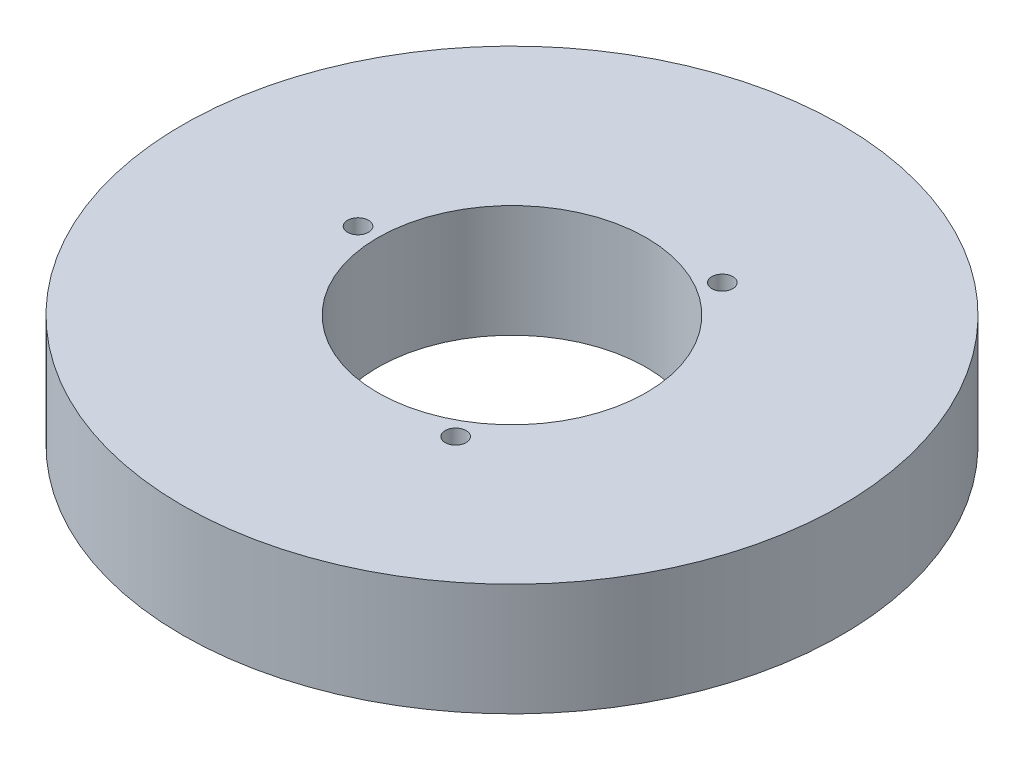
ISO-10303-21;
HEADER;
FILE_DESCRIPTION(('STEP AP214'),'2;1');
FILE_NAME('part.step','',(''),(''),'','','');
FILE_SCHEMA(('AUTOMOTIVE_DESIGN { 1 0 10303 214 1 1 1 1 }'));
ENDSEC;
DATA;
#1=APPLICATION_CONTEXT('core data for automotive mechanical design processes');
#2=APPLICATION_PROTOCOL_DEFINITION('international standard','automotive_design',2000,#1);
#3=PRODUCT_CONTEXT('',#1,'mechanical');
#4=PRODUCT('Part','Part','',(#3));
#5=PRODUCT_RELATED_PRODUCT_CATEGORY('part','',(#4));
#6=PRODUCT_DEFINITION_FORMATION('','',#4);
#7=PRODUCT_DEFINITION_CONTEXT('part definition',#1,'design');
#8=PRODUCT_DEFINITION('design','',#6,#7);
#9=PRODUCT_DEFINITION_SHAPE('','',#8);
#10=(LENGTH_UNIT() NAMED_UNIT(*) SI_UNIT(.MILLI.,.METRE.));
#11=(NAMED_UNIT(*) PLANE_ANGLE_UNIT() SI_UNIT($,.RADIAN.));
#12=(NAMED_UNIT(*) SI_UNIT($,.STERADIAN.) SOLID_ANGLE_UNIT());
#13=UNCERTAINTY_MEASURE_WITH_UNIT(LENGTH_MEASURE(1.E-05),#10,'distance_accuracy_value','');
#14=(GEOMETRIC_REPRESENTATION_CONTEXT(3) GLOBAL_UNCERTAINTY_ASSIGNED_CONTEXT((#13)) GLOBAL_UNIT_ASSIGNED_CONTEXT((#10,
#11,#12)) REPRESENTATION_CONTEXT('',''));
#15=CARTESIAN_POINT('',(0.,0.,0.));
#16=DIRECTION('',(0.,0.,1.));
#17=DIRECTION('',(1.,0.,0.));
#18=AXIS2_PLACEMENT_3D('',#15,#16,#17);
#19=CARTESIAN_POINT('',(0.,23.,0.));
#20=DIRECTION('',(0.,-1.,0.));
#21=DIRECTION('',(0.,0.,-1.));
#22=AXIS2_PLACEMENT_3D('',#19,#20,#21);
#23=CYLINDRICAL_SURFACE('',#22,67.5);
#24=CARTESIAN_POINT('',(0.,23.,0.));
#25=DIRECTION('',(0.,1.,0.));
#26=DIRECTION('',(0.,0.,1.));
#27=AXIS2_PLACEMENT_3D('',#24,#25,#26);
#28=CIRCLE('',#27,67.5);
#29=CARTESIAN_POINT('',(0.,23.,67.5));
#30=VERTEX_POINT('',#29);
#31=EDGE_CURVE('E10',#30,#30,#28,.T.);
#32=ORIENTED_EDGE('',*,*,#31,.F.);
#33=EDGE_LOOP('',(#32));
#34=FACE_BOUND('',#33,.T.);
#35=CARTESIAN_POINT('',(0.,0.,0.));
#36=DIRECTION('',(0.,1.,0.));
#37=DIRECTION('',(0.,0.,1.));
#38=AXIS2_PLACEMENT_3D('',#35,#36,#37);
#39=CIRCLE('',#38,67.5);
#40=CARTESIAN_POINT('',(0.,0.,67.5));
#41=VERTEX_POINT('',#40);
#42=EDGE_CURVE('E37',#41,#41,#39,.T.);
#43=ORIENTED_EDGE('',*,*,#42,.T.);
#44=EDGE_LOOP('',(#43));
#45=FACE_BOUND('',#44,.T.);
#46=ADVANCED_FACE('F40',(#34,#45),#23,.T.);
#47=CARTESIAN_POINT('',(0.,23.,0.));
#48=DIRECTION('',(0.,1.,0.));
#49=DIRECTION('',(0.,0.,1.));
#50=AXIS2_PLACEMENT_3D('',#47,#48,#49);
#51=PLANE('',#50);
#52=CARTESIAN_POINT('',(15.7669962282839,23.,27.3092385501344));
#53=DIRECTION('',(0.,1.,0.));
#54=DIRECTION('',(0.866025403784436,0.,-0.500000000000004));
#55=AXIS2_PLACEMENT_3D('',#52,#53,#54);
#56=CIRCLE('',#55,2.14732946866466);
#57=CARTESIAN_POINT('',(17.6266380984425,23.,26.235573815802));
#58=VERTEX_POINT('',#57);
#59=EDGE_CURVE('E70',#58,#58,#56,.T.);
#60=ORIENTED_EDGE('',*,*,#59,.F.);
#61=EDGE_LOOP('',(#60));
#62=FACE_BOUND('',#61,.T.);
#63=CARTESIAN_POINT('',(15.7669962282836,23.,-27.3092385501346));
#64=DIRECTION('',(0.,1.,0.));
#65=DIRECTION('',(-0.866025403784443,0.,-0.499999999999992));
#66=AXIS2_PLACEMENT_3D('',#63,#64,#65);
#67=CIRCLE('',#66,2.14732946866466);
#68=CARTESIAN_POINT('',(13.907354358125,23.,-28.3829032844669));
#69=VERTEX_POINT('',#68);
#70=EDGE_CURVE('E61',#69,#69,#67,.T.);
#71=ORIENTED_EDGE('',*,*,#70,.F.);
#72=EDGE_LOOP('',(#71));
#73=FACE_BOUND('',#72,.T.);
#74=CARTESIAN_POINT('',(-31.5339924565676,23.,0.));
#75=DIRECTION('',(0.,1.,0.));
#76=DIRECTION('',(0.,0.,1.));
#77=AXIS2_PLACEMENT_3D('',#74,#75,#76);
#78=CIRCLE('',#77,2.14732946866466);
#79=CARTESIAN_POINT('',(-31.5339924565676,23.,2.14732946866466));
#80=VERTEX_POINT('',#79);
#81=EDGE_CURVE('E54',#80,#80,#78,.T.);
#82=ORIENTED_EDGE('',*,*,#81,.F.);
#83=EDGE_LOOP('',(#82));
#84=FACE_BOUND('',#83,.T.);
#85=CARTESIAN_POINT('',(0.,23.,0.));
#86=DIRECTION('',(0.,1.,0.));
#87=DIRECTION('',(0.,0.,1.));
#88=AXIS2_PLACEMENT_3D('',#85,#86,#87);
#89=CIRCLE('',#88,27.5);
#90=CARTESIAN_POINT('',(0.,23.,27.5));
#91=VERTEX_POINT('',#90);
#92=EDGE_CURVE('E50',#91,#91,#89,.T.);
#93=ORIENTED_EDGE('',*,*,#92,.F.);
#94=EDGE_LOOP('',(#93));
#95=FACE_BOUND('',#94,.T.);
#96=ORIENTED_EDGE('',*,*,#31,.T.);
#97=EDGE_LOOP('',(#96));
#98=FACE_BOUND('',#97,.T.);
#99=ADVANCED_FACE('F85',(#62,#73,#84,#95,#98),#51,.T.);
#100=CARTESIAN_POINT('',(0.,0.,0.));
#101=DIRECTION('',(0.,1.,0.));
#102=DIRECTION('',(0.,0.,1.));
#103=AXIS2_PLACEMENT_3D('',#100,#101,#102);
#104=PLANE('',#103);
#105=CARTESIAN_POINT('',(0.,0.,0.));
#106=DIRECTION('',(0.,1.,0.));
#107=DIRECTION('',(0.,0.,1.));
#108=AXIS2_PLACEMENT_3D('',#105,#106,#107);
#109=CIRCLE('',#108,27.5);
#110=CARTESIAN_POINT('',(0.,0.,27.5));
#111=VERTEX_POINT('',#110);
#112=EDGE_CURVE('E47',#111,#111,#109,.T.);
#113=ORIENTED_EDGE('',*,*,#112,.T.);
#114=EDGE_LOOP('',(#113));
#115=FACE_BOUND('',#114,.T.);
#116=ORIENTED_EDGE('',*,*,#42,.F.);
#117=EDGE_LOOP('',(#116));
#118=FACE_BOUND('',#117,.T.);
#119=ADVANCED_FACE('F84',(#115,#118),#104,.F.);
#120=CARTESIAN_POINT('',(0.,23.,0.));
#121=DIRECTION('',(0.,-1.,0.));
#122=DIRECTION('',(0.,0.,-1.));
#123=AXIS2_PLACEMENT_3D('',#120,#121,#122);
#124=CYLINDRICAL_SURFACE('',#123,27.5);
#125=ORIENTED_EDGE('',*,*,#92,.T.);
#126=EDGE_LOOP('',(#125));
#127=FACE_BOUND('',#126,.T.);
#128=ORIENTED_EDGE('',*,*,#112,.F.);
#129=EDGE_LOOP('',(#128));
#130=FACE_BOUND('',#129,.T.);
#131=ADVANCED_FACE('F91',(#127,#130),#124,.F.);
#132=CARTESIAN_POINT('',(-31.5339924565676,8.66104210718896,0.));
#133=DIRECTION('',(0.,1.,0.));
#134=DIRECTION('',(0.,0.,1.));
#135=AXIS2_PLACEMENT_3D('',#132,#133,#134);
#136=CYLINDRICAL_SURFACE('',#135,2.14732946866466);
#137=CARTESIAN_POINT('',(-31.5339924565676,8.66104210718896,0.));
#138=DIRECTION('',(0.,1.,0.));
#139=DIRECTION('',(0.,0.,1.));
#140=AXIS2_PLACEMENT_3D('',#137,#138,#139);
#141=CIRCLE('',#140,2.14732946866466);
#142=CARTESIAN_POINT('',(-31.5339924565676,8.66104210718896,2.14732946866466));
#143=VERTEX_POINT('',#142);
#144=EDGE_CURVE('E55',#143,#143,#141,.T.);
#145=ORIENTED_EDGE('',*,*,#144,.F.);
#146=EDGE_LOOP('',(#145));
#147=FACE_BOUND('',#146,.T.);
#148=ORIENTED_EDGE('',*,*,#81,.T.);
#149=EDGE_LOOP('',(#148));
#150=FACE_BOUND('',#149,.T.);
#151=ADVANCED_FACE('F96',(#147,#150),#136,.F.);
#152=CARTESIAN_POINT('',(-31.5339924565676,8.66104210718896,0.));
#153=DIRECTION('',(0.,1.,0.));
#154=DIRECTION('',(0.,0.,1.));
#155=AXIS2_PLACEMENT_3D('',#152,#153,#154);
#156=PLANE('',#155);
#157=ORIENTED_EDGE('',*,*,#144,.T.);
#158=EDGE_LOOP('',(#157));
#159=FACE_BOUND('',#158,.T.);
#160=ADVANCED_FACE('F127',(#159),#156,.T.);
#161=CARTESIAN_POINT('',(15.7669962282836,8.66104210718896,-27.3092385501346));
#162=DIRECTION('',(0.,1.,0.));
#163=DIRECTION('',(0.,0.,1.));
#164=AXIS2_PLACEMENT_3D('',#161,#162,#163);
#165=CYLINDRICAL_SURFACE('',#164,2.14732946866466);
#166=CARTESIAN_POINT('',(15.7669962282836,8.66104210718896,-27.3092385501346));
#167=DIRECTION('',(0.,1.,0.));
#168=DIRECTION('',(-0.866025403784443,0.,-0.499999999999992));
#169=AXIS2_PLACEMENT_3D('',#166,#167,#168);
#170=CIRCLE('',#169,2.14732946866466);
#171=CARTESIAN_POINT('',(13.907354358125,8.66104210718896,-28.3829032844669));
#172=VERTEX_POINT('',#171);
#173=EDGE_CURVE('E63',#172,#172,#170,.T.);
#174=ORIENTED_EDGE('',*,*,#173,.F.);
#175=EDGE_LOOP('',(#174));
#176=FACE_BOUND('',#175,.T.);
#177=ORIENTED_EDGE('',*,*,#70,.T.);
#178=EDGE_LOOP('',(#177));
#179=FACE_BOUND('',#178,.T.);
#180=ADVANCED_FACE('F133',(#176,#179),#165,.F.);
#181=CARTESIAN_POINT('',(15.7669962282836,8.66104210718896,-27.3092385501346));
#182=DIRECTION('',(0.,1.,0.));
#183=DIRECTION('',(-0.866025403784443,0.,-0.499999999999992));
#184=AXIS2_PLACEMENT_3D('',#181,#182,#183);
#185=PLANE('',#184);
#186=ORIENTED_EDGE('',*,*,#173,.T.);
#187=EDGE_LOOP('',(#186));
#188=FACE_BOUND('',#187,.T.);
#189=ADVANCED_FACE('F77',(#188),#185,.T.);
#190=CARTESIAN_POINT('',(15.7669962282839,8.66104210718896,27.3092385501344));
#191=DIRECTION('',(0.,1.,0.));
#192=DIRECTION('',(0.,0.,1.));
#193=AXIS2_PLACEMENT_3D('',#190,#191,#192);
#194=CYLINDRICAL_SURFACE('',#193,2.14732946866466);
#195=CARTESIAN_POINT('',(15.7669962282839,8.66104210718896,27.3092385501344));
#196=DIRECTION('',(0.,1.,0.));
#197=DIRECTION('',(0.866025403784436,0.,-0.500000000000004));
#198=AXIS2_PLACEMENT_3D('',#195,#196,#197);
#199=CIRCLE('',#198,2.14732946866466);
#200=CARTESIAN_POINT('',(17.6266380984425,8.66104210718896,26.235573815802));
#201=VERTEX_POINT('',#200);
#202=EDGE_CURVE('E59',#201,#201,#199,.T.);
#203=ORIENTED_EDGE('',*,*,#202,.F.);
#204=EDGE_LOOP('',(#203));
#205=FACE_BOUND('',#204,.T.);
#206=ORIENTED_EDGE('',*,*,#59,.T.);
#207=EDGE_LOOP('',(#206));
#208=FACE_BOUND('',#207,.T.);
#209=ADVANCED_FACE('F73',(#205,#208),#194,.F.);
#210=CARTESIAN_POINT('',(15.7669962282839,8.66104210718896,27.3092385501344));
#211=DIRECTION('',(0.,1.,0.));
#212=DIRECTION('',(0.866025403784436,0.,-0.500000000000004));
#213=AXIS2_PLACEMENT_3D('',#210,#211,#212);
#214=PLANE('',#213);
#215=ORIENTED_EDGE('',*,*,#202,.T.);
#216=EDGE_LOOP('',(#215));
#217=FACE_BOUND('',#216,.T.);
#218=ADVANCED_FACE('F71',(#217),#214,.T.);
#219=CLOSED_SHELL('',(#46,#99,#119,#131,#151,#160,#180,#189,#209,#218));
#220=MANIFOLD_SOLID_BREP('B2',#219);
#221=ADVANCED_BREP_SHAPE_REPRESENTATION('',(#18,#220),#14);
#222=SHAPE_DEFINITION_REPRESENTATION(#9,#221);
ENDSEC;
END-ISO-10303-21;
